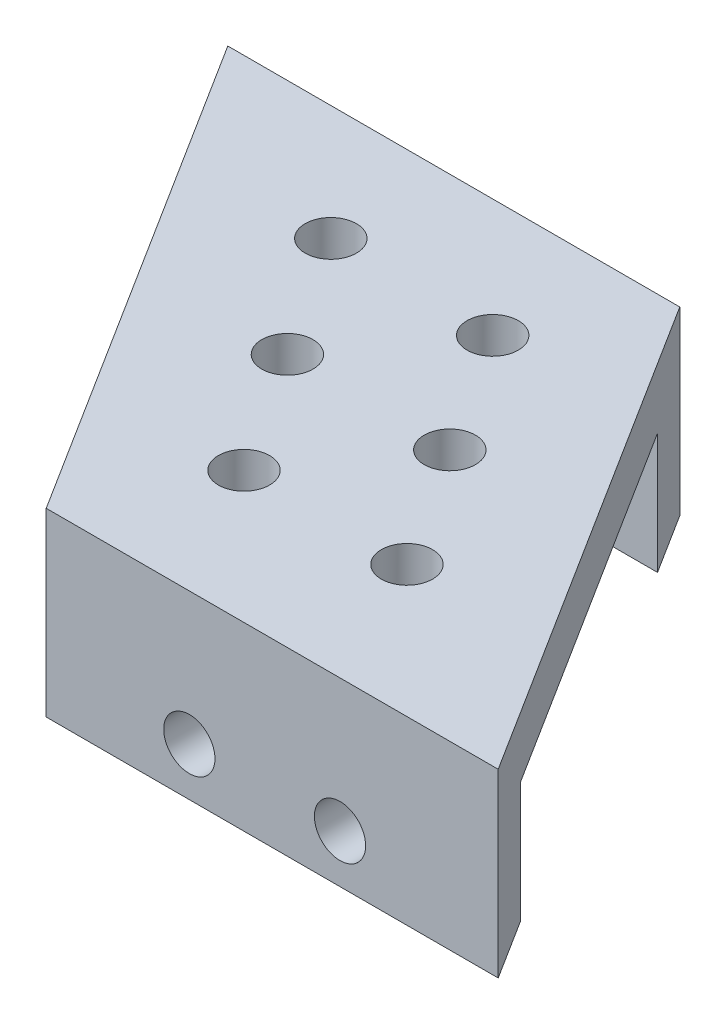
ISO-10303-21;
HEADER;
FILE_DESCRIPTION(('STEP AP214'),'2;1');
FILE_NAME('part.step','',(''),(''),'','','');
FILE_SCHEMA(('AUTOMOTIVE_DESIGN { 1 0 10303 214 1 1 1 1 }'));
ENDSEC;
DATA;
#1=APPLICATION_CONTEXT('core data for automotive mechanical design processes');
#2=APPLICATION_PROTOCOL_DEFINITION('international standard','automotive_design',2000,#1);
#3=PRODUCT_CONTEXT('',#1,'mechanical');
#4=PRODUCT('Part','Part','',(#3));
#5=PRODUCT_RELATED_PRODUCT_CATEGORY('part','',(#4));
#6=PRODUCT_DEFINITION_FORMATION('','',#4);
#7=PRODUCT_DEFINITION_CONTEXT('part definition',#1,'design');
#8=PRODUCT_DEFINITION('design','',#6,#7);
#9=PRODUCT_DEFINITION_SHAPE('','',#8);
#10=(LENGTH_UNIT() NAMED_UNIT(*) SI_UNIT(.MILLI.,.METRE.));
#11=(NAMED_UNIT(*) PLANE_ANGLE_UNIT() SI_UNIT($,.RADIAN.));
#12=(NAMED_UNIT(*) SI_UNIT($,.STERADIAN.) SOLID_ANGLE_UNIT());
#13=UNCERTAINTY_MEASURE_WITH_UNIT(LENGTH_MEASURE(1.E-05),#10,'distance_accuracy_value','');
#14=(GEOMETRIC_REPRESENTATION_CONTEXT(3) GLOBAL_UNCERTAINTY_ASSIGNED_CONTEXT((#13)) GLOBAL_UNIT_ASSIGNED_CONTEXT((#10,
#11,#12)) REPRESENTATION_CONTEXT('',''));
#15=CARTESIAN_POINT('',(0.,0.,0.));
#16=DIRECTION('',(0.,0.,1.));
#17=DIRECTION('',(1.,0.,0.));
#18=AXIS2_PLACEMENT_3D('',#15,#16,#17);
#19=CARTESIAN_POINT('',(0.,0.,0.));
#20=DIRECTION('',(0.,-1.,0.));
#21=DIRECTION('',(0.,0.,-1.));
#22=AXIS2_PLACEMENT_3D('',#19,#20,#21);
#23=PLANE('',#22);
#24=CARTESIAN_POINT('',(7.32925933436086,0.,16.7877627221562));
#25=DIRECTION('',(0.,-1.,0.));
#26=DIRECTION('',(0.,0.,-1.));
#27=AXIS2_PLACEMENT_3D('',#24,#25,#26);
#28=CIRCLE('',#27,1.70000000000051);
#29=CARTESIAN_POINT('',(7.32925933436086,0.,15.0877627221556));
#30=VERTEX_POINT('',#29);
#31=EDGE_CURVE('E127',#30,#30,#28,.T.);
#32=ORIENTED_EDGE('',*,*,#31,.F.);
#33=EDGE_LOOP('',(#32));
#34=FACE_BOUND('',#33,.T.);
#35=CARTESIAN_POINT('',(2.17031031728642,0.,8.78305398097484));
#36=DIRECTION('',(0.,-1.,0.));
#37=DIRECTION('',(0.,0.,-1.));
#38=AXIS2_PLACEMENT_3D('',#35,#36,#37);
#39=CIRCLE('',#38,1.70000000000056);
#40=CARTESIAN_POINT('',(2.17031031728642,0.,7.08305398097428));
#41=VERTEX_POINT('',#40);
#42=EDGE_CURVE('E224',#41,#41,#39,.T.);
#43=ORIENTED_EDGE('',*,*,#42,.F.);
#44=EDGE_LOOP('',(#43));
#45=FACE_BOUND('',#44,.T.);
#46=CARTESIAN_POINT('',(-2.98863869978802,0.,0.778345239793518));
#47=DIRECTION('',(0.,-1.,0.));
#48=DIRECTION('',(0.,0.,-1.));
#49=AXIS2_PLACEMENT_3D('',#46,#47,#48);
#50=CIRCLE('',#49,1.70000000000013);
#51=CARTESIAN_POINT('',(-2.98863869978802,0.,-0.921654760206616));
#52=VERTEX_POINT('',#51);
#53=EDGE_CURVE('E222',#52,#52,#50,.T.);
#54=ORIENTED_EDGE('',*,*,#53,.F.);
#55=EDGE_LOOP('',(#54));
#56=FACE_BOUND('',#55,.T.);
#57=CARTESIAN_POINT('',(-13.935807221514,0.,0.576164262539937));
#58=DIRECTION('',(0.,-1.,0.));
#59=DIRECTION('',(0.,0.,-1.));
#60=AXIS2_PLACEMENT_3D('',#57,#58,#59);
#61=CIRCLE('',#60,1.69999999999991);
#62=CARTESIAN_POINT('',(-13.935807221514,0.,-1.12383573745998));
#63=VERTEX_POINT('',#62);
#64=EDGE_CURVE('E219',#63,#63,#61,.T.);
#65=ORIENTED_EDGE('',*,*,#64,.F.);
#66=EDGE_LOOP('',(#65));
#67=FACE_BOUND('',#66,.T.);
#68=CARTESIAN_POINT('',(-8.71170646765569,0.,8.68196349234805));
#69=DIRECTION('',(0.,-1.,0.));
#70=DIRECTION('',(0.,0.,-1.));
#71=AXIS2_PLACEMENT_3D('',#68,#69,#70);
#72=CIRCLE('',#71,1.69999999999991);
#73=CARTESIAN_POINT('',(-8.71170646765569,0.,6.98196349234813));
#74=VERTEX_POINT('',#73);
#75=EDGE_CURVE('E216',#74,#74,#72,.T.);
#76=ORIENTED_EDGE('',*,*,#75,.F.);
#77=EDGE_LOOP('',(#76));
#78=FACE_BOUND('',#77,.T.);
#79=CARTESIAN_POINT('',(-3.48760571379741,0.,16.7877627221562));
#80=DIRECTION('',(0.,-1.,0.));
#81=DIRECTION('',(0.,0.,-1.));
#82=AXIS2_PLACEMENT_3D('',#79,#80,#81);
#83=CIRCLE('',#82,1.6999999999999);
#84=CARTESIAN_POINT('',(-3.48760571379741,0.,15.0877627221563));
#85=VERTEX_POINT('',#84);
#86=EDGE_CURVE('E213',#85,#85,#83,.T.);
#87=ORIENTED_EDGE('',*,*,#86,.F.);
#88=EDGE_LOOP('',(#87));
#89=FACE_BOUND('',#88,.T.);
#90=DIRECTION('',(-0.533210396162134,0.,-0.845982667331087));
#91=VECTOR('',#90,1.);
#92=CARTESIAN_POINT('',(1.58596151656593,0.,-7.06464984269321));
#93=LINE('',#92,#91);
#94=CARTESIAN_POINT('',(19.6121196391044,0.,21.5353501573068));
#95=VERTEX_POINT('',#94);
#96=CARTESIAN_POINT('',(4.10710251272519,0.,-3.06464984269317));
#97=VERTEX_POINT('',#96);
#98=EDGE_CURVE('E59',#95,#97,#93,.T.);
#99=ORIENTED_EDGE('',*,*,#98,.F.);
#100=DIRECTION('',(1.,0.,0.));
#101=VECTOR('',#100,1.);
#102=CARTESIAN_POINT('',(-10.3878803608956,0.,21.5353501573068));
#103=LINE('',#102,#101);
#104=CARTESIAN_POINT('',(-10.3878803608956,0.,21.5353501573068));
#105=VERTEX_POINT('',#104);
#106=EDGE_CURVE('E125',#105,#95,#103,.T.);
#107=ORIENTED_EDGE('',*,*,#106,.F.);
#108=DIRECTION('',(0.533210396162134,0.,0.845982667331087));
#109=VECTOR('',#108,1.);
#110=CARTESIAN_POINT('',(-7.86673936473637,0.,25.5353501573068));
#111=LINE('',#110,#109);
#112=CARTESIAN_POINT('',(-25.8928974872748,0.,-3.06464984269316));
#113=VERTEX_POINT('',#112);
#114=EDGE_CURVE('E156',#113,#105,#111,.T.);
#115=ORIENTED_EDGE('',*,*,#114,.F.);
#116=DIRECTION('',(-1.,0.,0.));
#117=VECTOR('',#116,1.);
#118=CARTESIAN_POINT('',(-25.8928974872748,0.,-3.06464984269316));
#119=LINE('',#118,#117);
#120=EDGE_CURVE('E137',#97,#113,#119,.T.);
#121=ORIENTED_EDGE('',*,*,#120,.F.);
#122=EDGE_LOOP('',(#99,#107,#115,#121));
#123=FACE_BOUND('',#122,.T.);
#124=ADVANCED_FACE('F34',(#34,#45,#56,#67,#78,#89,#123),#23,.T.);
#125=CARTESIAN_POINT('',(-28.4140384834341,4.,-7.06464984269316));
#126=DIRECTION('',(0.,0.,1.));
#127=DIRECTION('',(1.,0.,0.));
#128=AXIS2_PLACEMENT_3D('',#125,#126,#127);
#129=PLANE('',#128);
#130=CARTESIAN_POINT('',(-9.41403848343407,-4.8,-7.06464984269319));
#131=DIRECTION('',(0.,0.,-1.));
#132=DIRECTION('',(-1.,0.,0.));
#133=AXIS2_PLACEMENT_3D('',#130,#131,#132);
#134=CIRCLE('',#133,1.7);
#135=CARTESIAN_POINT('',(-11.1140384834341,-4.8,-7.06464984269319));
#136=VERTEX_POINT('',#135);
#137=EDGE_CURVE('E179',#136,#136,#134,.T.);
#138=ORIENTED_EDGE('',*,*,#137,.F.);
#139=EDGE_LOOP('',(#138));
#140=FACE_BOUND('',#139,.T.);
#141=CARTESIAN_POINT('',(-19.4140384834341,-4.8,-7.06464984269317));
#142=DIRECTION('',(0.,0.,-1.));
#143=DIRECTION('',(-1.,0.,0.));
#144=AXIS2_PLACEMENT_3D('',#141,#142,#143);
#145=CIRCLE('',#144,1.7);
#146=CARTESIAN_POINT('',(-21.1140384834341,-4.8,-7.06464984269317));
#147=VERTEX_POINT('',#146);
#148=EDGE_CURVE('E185',#147,#147,#145,.T.);
#149=ORIENTED_EDGE('',*,*,#148,.F.);
#150=EDGE_LOOP('',(#149));
#151=FACE_BOUND('',#150,.T.);
#152=DIRECTION('',(0.,-1.,0.));
#153=VECTOR('',#152,1.);
#154=CARTESIAN_POINT('',(1.58596151656593,4.,-7.06464984269321));
#155=LINE('',#154,#153);
#156=CARTESIAN_POINT('',(1.58596151656593,4.,-7.06464984269321));
#157=VERTEX_POINT('',#156);
#158=CARTESIAN_POINT('',(1.58596151656593,-8.,-7.06464984269321));
#159=VERTEX_POINT('',#158);
#160=EDGE_CURVE('E112',#157,#159,#155,.T.);
#161=ORIENTED_EDGE('',*,*,#160,.T.);
#162=DIRECTION('',(1.,0.,0.));
#163=VECTOR('',#162,1.);
#164=CARTESIAN_POINT('',(1.58596151656593,-8.,-7.06464984269321));
#165=LINE('',#164,#163);
#166=CARTESIAN_POINT('',(-28.4140384834341,-8.,-7.06464984269316));
#167=VERTEX_POINT('',#166);
#168=EDGE_CURVE('E138',#167,#159,#165,.T.);
#169=ORIENTED_EDGE('',*,*,#168,.F.);
#170=DIRECTION('',(0.,-1.,0.));
#171=VECTOR('',#170,1.);
#172=CARTESIAN_POINT('',(-28.4140384834341,4.,-7.06464984269316));
#173=LINE('',#172,#171);
#174=CARTESIAN_POINT('',(-28.4140384834341,4.,-7.06464984269316));
#175=VERTEX_POINT('',#174);
#176=EDGE_CURVE('E11',#175,#167,#173,.T.);
#177=ORIENTED_EDGE('',*,*,#176,.F.);
#178=DIRECTION('',(-1.,0.,0.));
#179=VECTOR('',#178,1.);
#180=CARTESIAN_POINT('',(-28.4140384834341,4.,-7.06464984269316));
#181=LINE('',#180,#179);
#182=EDGE_CURVE('E157',#157,#175,#181,.T.);
#183=ORIENTED_EDGE('',*,*,#182,.F.);
#184=EDGE_LOOP('',(#161,#169,#177,#183));
#185=FACE_BOUND('',#184,.T.);
#186=ADVANCED_FACE('F36',(#140,#151,#185),#129,.F.);
#187=CARTESIAN_POINT('',(-7.86673936473637,4.,25.5353501573068));
#188=DIRECTION('',(0.845982667331087,0.,-0.533210396162134));
#189=DIRECTION('',(-0.533210396162134,0.,-0.845982667331087));
#190=AXIS2_PLACEMENT_3D('',#187,#188,#189);
#191=PLANE('',#190);
#192=ORIENTED_EDGE('',*,*,#176,.T.);
#193=DIRECTION('',(-0.533210396162134,0.,-0.845982667331087));
#194=VECTOR('',#193,1.);
#195=CARTESIAN_POINT('',(-28.4140384834341,-8.,-7.06464984269316));
#196=LINE('',#195,#194);
#197=CARTESIAN_POINT('',(-25.8928974872748,-8.,-3.06464984269316));
#198=VERTEX_POINT('',#197);
#199=EDGE_CURVE('E145',#198,#167,#196,.T.);
#200=ORIENTED_EDGE('',*,*,#199,.F.);
#201=DIRECTION('',(0.,1.,0.));
#202=VECTOR('',#201,1.);
#203=CARTESIAN_POINT('',(-25.8928974872748,-8.,-3.06464984269316));
#204=LINE('',#203,#202);
#205=EDGE_CURVE('E148',#198,#113,#204,.T.);
#206=ORIENTED_EDGE('',*,*,#205,.T.);
#207=ORIENTED_EDGE('',*,*,#114,.T.);
#208=DIRECTION('',(0.,1.,0.));
#209=VECTOR('',#208,1.);
#210=CARTESIAN_POINT('',(-10.3878803608956,-8.,21.5353501573068));
#211=LINE('',#210,#209);
#212=CARTESIAN_POINT('',(-10.3878803608956,-8.,21.5353501573068));
#213=VERTEX_POINT('',#212);
#214=EDGE_CURVE('E51',#213,#105,#211,.T.);
#215=ORIENTED_EDGE('',*,*,#214,.F.);
#216=DIRECTION('',(-0.533210396162133,0.,-0.845982667331087));
#217=VECTOR('',#216,1.);
#218=CARTESIAN_POINT('',(-7.86673936473637,-8.,25.5353501573068));
#219=LINE('',#218,#217);
#220=CARTESIAN_POINT('',(-7.86673936473637,-8.,25.5353501573068));
#221=VERTEX_POINT('',#220);
#222=EDGE_CURVE('E120',#221,#213,#219,.T.);
#223=ORIENTED_EDGE('',*,*,#222,.F.);
#224=DIRECTION('',(0.,-1.,0.));
#225=VECTOR('',#224,1.);
#226=CARTESIAN_POINT('',(-7.86673936473637,4.,25.5353501573068));
#227=LINE('',#226,#225);
#228=CARTESIAN_POINT('',(-7.86673936473637,4.,25.5353501573068));
#229=VERTEX_POINT('',#228);
#230=EDGE_CURVE('E43',#229,#221,#227,.T.);
#231=ORIENTED_EDGE('',*,*,#230,.F.);
#232=DIRECTION('',(0.533210396162134,0.,0.845982667331087));
#233=VECTOR('',#232,1.);
#234=CARTESIAN_POINT('',(-7.86673936473637,4.,25.5353501573068));
#235=LINE('',#234,#233);
#236=EDGE_CURVE('E160',#175,#229,#235,.T.);
#237=ORIENTED_EDGE('',*,*,#236,.F.);
#238=EDGE_LOOP('',(#192,#200,#206,#207,#215,#223,#231,#237));
#239=FACE_BOUND('',#238,.T.);
#240=ADVANCED_FACE('F261',(#239),#191,.F.);
#241=CARTESIAN_POINT('',(22.1332606352636,4.,25.5353501573068));
#242=DIRECTION('',(0.,0.,-1.));
#243=DIRECTION('',(-1.,0.,0.));
#244=AXIS2_PLACEMENT_3D('',#241,#242,#243);
#245=PLANE('',#244);
#246=CARTESIAN_POINT('',(1.63326063526363,-4.8,25.5353501573068));
#247=DIRECTION('',(0.,0.,1.));
#248=DIRECTION('',(1.,0.,0.));
#249=AXIS2_PLACEMENT_3D('',#246,#247,#248);
#250=CIRCLE('',#249,1.7);
#251=CARTESIAN_POINT('',(3.33326063526363,-4.8,25.5353501573068));
#252=VERTEX_POINT('',#251);
#253=EDGE_CURVE('E174',#252,#252,#250,.T.);
#254=ORIENTED_EDGE('',*,*,#253,.F.);
#255=EDGE_LOOP('',(#254));
#256=FACE_BOUND('',#255,.T.);
#257=CARTESIAN_POINT('',(11.6332606352636,-4.8,25.5353501573068));
#258=DIRECTION('',(0.,0.,1.));
#259=DIRECTION('',(1.,0.,0.));
#260=AXIS2_PLACEMENT_3D('',#257,#258,#259);
#261=CIRCLE('',#260,1.7);
#262=CARTESIAN_POINT('',(13.3332606352636,-4.8,25.5353501573068));
#263=VERTEX_POINT('',#262);
#264=EDGE_CURVE('E183',#263,#263,#261,.T.);
#265=ORIENTED_EDGE('',*,*,#264,.F.);
#266=EDGE_LOOP('',(#265));
#267=FACE_BOUND('',#266,.T.);
#268=ORIENTED_EDGE('',*,*,#230,.T.);
#269=DIRECTION('',(-1.,0.,0.));
#270=VECTOR('',#269,1.);
#271=CARTESIAN_POINT('',(22.1332606352636,-8.,25.5353501573068));
#272=LINE('',#271,#270);
#273=CARTESIAN_POINT('',(22.1332606352636,-8.,25.5353501573068));
#274=VERTEX_POINT('',#273);
#275=EDGE_CURVE('E115',#274,#221,#272,.T.);
#276=ORIENTED_EDGE('',*,*,#275,.F.);
#277=DIRECTION('',(0.,-1.,0.));
#278=VECTOR('',#277,1.);
#279=CARTESIAN_POINT('',(22.1332606352636,4.,25.5353501573068));
#280=LINE('',#279,#278);
#281=CARTESIAN_POINT('',(22.1332606352636,4.,25.5353501573068));
#282=VERTEX_POINT('',#281);
#283=EDGE_CURVE('E103',#282,#274,#280,.T.);
#284=ORIENTED_EDGE('',*,*,#283,.F.);
#285=DIRECTION('',(1.,0.,0.));
#286=VECTOR('',#285,1.);
#287=CARTESIAN_POINT('',(22.1332606352636,4.,25.5353501573068));
#288=LINE('',#287,#286);
#289=EDGE_CURVE('E162',#229,#282,#288,.T.);
#290=ORIENTED_EDGE('',*,*,#289,.F.);
#291=EDGE_LOOP('',(#268,#276,#284,#290));
#292=FACE_BOUND('',#291,.T.);
#293=ADVANCED_FACE('F116',(#256,#267,#292),#245,.F.);
#294=CARTESIAN_POINT('',(1.58596151656593,4.,-7.06464984269321));
#295=DIRECTION('',(-0.845982667331087,0.,0.533210396162134));
#296=DIRECTION('',(0.533210396162134,0.,0.845982667331087));
#297=AXIS2_PLACEMENT_3D('',#294,#295,#296);
#298=PLANE('',#297);
#299=ORIENTED_EDGE('',*,*,#283,.T.);
#300=DIRECTION('',(0.533210396162134,0.,0.845982667331087));
#301=VECTOR('',#300,1.);
#302=CARTESIAN_POINT('',(19.6121196391044,-8.,21.5353501573068));
#303=LINE('',#302,#301);
#304=CARTESIAN_POINT('',(19.6121196391044,-8.,21.5353501573068));
#305=VERTEX_POINT('',#304);
#306=EDGE_CURVE('E107',#305,#274,#303,.T.);
#307=ORIENTED_EDGE('',*,*,#306,.F.);
#308=DIRECTION('',(0.,1.,0.));
#309=VECTOR('',#308,1.);
#310=CARTESIAN_POINT('',(19.6121196391044,-8.,21.5353501573068));
#311=LINE('',#310,#309);
#312=EDGE_CURVE('E133',#305,#95,#311,.T.);
#313=ORIENTED_EDGE('',*,*,#312,.T.);
#314=ORIENTED_EDGE('',*,*,#98,.T.);
#315=DIRECTION('',(0.,1.,0.));
#316=VECTOR('',#315,1.);
#317=CARTESIAN_POINT('',(4.10710251272519,-8.,-3.06464984269316));
#318=LINE('',#317,#316);
#319=CARTESIAN_POINT('',(4.10710251272519,-8.,-3.06464984269316));
#320=VERTEX_POINT('',#319);
#321=EDGE_CURVE('E153',#320,#97,#318,.T.);
#322=ORIENTED_EDGE('',*,*,#321,.F.);
#323=DIRECTION('',(0.533210396162134,0.,0.845982667331087));
#324=VECTOR('',#323,1.);
#325=CARTESIAN_POINT('',(4.10710251272519,-8.,-3.06464984269316));
#326=LINE('',#325,#324);
#327=EDGE_CURVE('E141',#159,#320,#326,.T.);
#328=ORIENTED_EDGE('',*,*,#327,.F.);
#329=ORIENTED_EDGE('',*,*,#160,.F.);
#330=DIRECTION('',(-0.533210396162134,0.,-0.845982667331087));
#331=VECTOR('',#330,1.);
#332=CARTESIAN_POINT('',(1.58596151656593,4.,-7.06464984269321));
#333=LINE('',#332,#331);
#334=EDGE_CURVE('E109',#282,#157,#333,.T.);
#335=ORIENTED_EDGE('',*,*,#334,.F.);
#336=EDGE_LOOP('',(#299,#307,#313,#314,#322,#328,#329,#335));
#337=FACE_BOUND('',#336,.T.);
#338=ADVANCED_FACE('F105',(#337),#298,.F.);
#339=CARTESIAN_POINT('',(0.,4.,0.));
#340=DIRECTION('',(0.,-1.,0.));
#341=DIRECTION('',(0.,0.,-1.));
#342=AXIS2_PLACEMENT_3D('',#339,#340,#341);
#343=PLANE('',#342);
#344=CARTESIAN_POINT('',(7.32925933436086,4.,16.7877627221562));
#345=DIRECTION('',(0.,1.,0.));
#346=DIRECTION('',(0.,0.,1.));
#347=AXIS2_PLACEMENT_3D('',#344,#345,#346);
#348=CIRCLE('',#347,1.70000000000051);
#349=CARTESIAN_POINT('',(7.32925933436086,4.,18.4877627221567));
#350=VERTEX_POINT('',#349);
#351=EDGE_CURVE('E199',#350,#350,#348,.T.);
#352=ORIENTED_EDGE('',*,*,#351,.F.);
#353=EDGE_LOOP('',(#352));
#354=FACE_BOUND('',#353,.T.);
#355=CARTESIAN_POINT('',(2.17031031728642,4.,8.78305398097484));
#356=DIRECTION('',(0.,1.,0.));
#357=DIRECTION('',(0.,0.,1.));
#358=AXIS2_PLACEMENT_3D('',#355,#356,#357);
#359=CIRCLE('',#358,1.70000000000056);
#360=CARTESIAN_POINT('',(2.17031031728642,4.,10.4830539809754));
#361=VERTEX_POINT('',#360);
#362=EDGE_CURVE('E203',#361,#361,#359,.T.);
#363=ORIENTED_EDGE('',*,*,#362,.F.);
#364=EDGE_LOOP('',(#363));
#365=FACE_BOUND('',#364,.T.);
#366=CARTESIAN_POINT('',(-2.98863869978802,4.,0.778345239793518));
#367=DIRECTION('',(0.,1.,0.));
#368=DIRECTION('',(0.,0.,1.));
#369=AXIS2_PLACEMENT_3D('',#366,#367,#368);
#370=CIRCLE('',#369,1.70000000000013);
#371=CARTESIAN_POINT('',(-2.98863869978802,4.,2.47834523979365));
#372=VERTEX_POINT('',#371);
#373=EDGE_CURVE('E206',#372,#372,#370,.T.);
#374=ORIENTED_EDGE('',*,*,#373,.F.);
#375=EDGE_LOOP('',(#374));
#376=FACE_BOUND('',#375,.T.);
#377=CARTESIAN_POINT('',(-13.935807221514,4.,0.576164262539937));
#378=DIRECTION('',(0.,1.,0.));
#379=DIRECTION('',(0.,0.,1.));
#380=AXIS2_PLACEMENT_3D('',#377,#378,#379);
#381=CIRCLE('',#380,1.69999999999991);
#382=CARTESIAN_POINT('',(-13.935807221514,4.,2.27616426253985));
#383=VERTEX_POINT('',#382);
#384=EDGE_CURVE('E198',#383,#383,#381,.T.);
#385=ORIENTED_EDGE('',*,*,#384,.F.);
#386=EDGE_LOOP('',(#385));
#387=FACE_BOUND('',#386,.T.);
#388=CARTESIAN_POINT('',(-8.71170646765569,4.,8.68196349234805));
#389=DIRECTION('',(0.,1.,0.));
#390=DIRECTION('',(0.,0.,1.));
#391=AXIS2_PLACEMENT_3D('',#388,#389,#390);
#392=CIRCLE('',#391,1.69999999999991);
#393=CARTESIAN_POINT('',(-8.71170646765569,4.,10.381963492348));
#394=VERTEX_POINT('',#393);
#395=EDGE_CURVE('E176',#394,#394,#392,.T.);
#396=ORIENTED_EDGE('',*,*,#395,.F.);
#397=EDGE_LOOP('',(#396));
#398=FACE_BOUND('',#397,.T.);
#399=CARTESIAN_POINT('',(-3.48760571379741,4.,16.7877627221562));
#400=DIRECTION('',(0.,1.,0.));
#401=DIRECTION('',(0.,0.,1.));
#402=AXIS2_PLACEMENT_3D('',#399,#400,#401);
#403=CIRCLE('',#402,1.6999999999999);
#404=CARTESIAN_POINT('',(-3.48760571379741,4.,18.4877627221561));
#405=VERTEX_POINT('',#404);
#406=EDGE_CURVE('E202',#405,#405,#403,.T.);
#407=ORIENTED_EDGE('',*,*,#406,.F.);
#408=EDGE_LOOP('',(#407));
#409=FACE_BOUND('',#408,.T.);
#410=ORIENTED_EDGE('',*,*,#182,.T.);
#411=ORIENTED_EDGE('',*,*,#236,.T.);
#412=ORIENTED_EDGE('',*,*,#289,.T.);
#413=ORIENTED_EDGE('',*,*,#334,.T.);
#414=EDGE_LOOP('',(#410,#411,#412,#413));
#415=FACE_BOUND('',#414,.T.);
#416=ADVANCED_FACE('F259',(#354,#365,#376,#387,#398,#409,#415),#343,.F.);
#417=CARTESIAN_POINT('',(-25.8928974872748,-8.,-3.06464984269316));
#418=DIRECTION('',(0.,0.,-1.));
#419=DIRECTION('',(-1.,0.,0.));
#420=AXIS2_PLACEMENT_3D('',#417,#418,#419);
#421=PLANE('',#420);
#422=CARTESIAN_POINT('',(-9.41403848343406,-4.8,-3.06464984269317));
#423=DIRECTION('',(0.,0.,-1.));
#424=DIRECTION('',(-1.,0.,0.));
#425=AXIS2_PLACEMENT_3D('',#422,#423,#424);
#426=CIRCLE('',#425,1.7);
#427=CARTESIAN_POINT('',(-11.1140384834341,-4.8,-3.06464984269317));
#428=VERTEX_POINT('',#427);
#429=EDGE_CURVE('E38',#428,#428,#426,.T.);
#430=ORIENTED_EDGE('',*,*,#429,.T.);
#431=EDGE_LOOP('',(#430));
#432=FACE_BOUND('',#431,.T.);
#433=CARTESIAN_POINT('',(-19.4140384834341,-4.8,-3.06464984269316));
#434=DIRECTION('',(0.,0.,-1.));
#435=DIRECTION('',(-1.,0.,0.));
#436=AXIS2_PLACEMENT_3D('',#433,#434,#435);
#437=CIRCLE('',#436,1.7);
#438=CARTESIAN_POINT('',(-21.1140384834341,-4.8,-3.06464984269316));
#439=VERTEX_POINT('',#438);
#440=EDGE_CURVE('E177',#439,#439,#437,.T.);
#441=ORIENTED_EDGE('',*,*,#440,.T.);
#442=EDGE_LOOP('',(#441));
#443=FACE_BOUND('',#442,.T.);
#444=ORIENTED_EDGE('',*,*,#120,.T.);
#445=ORIENTED_EDGE('',*,*,#205,.F.);
#446=DIRECTION('',(-1.,0.,0.));
#447=VECTOR('',#446,1.);
#448=CARTESIAN_POINT('',(-25.8928974872748,-8.,-3.06464984269316));
#449=LINE('',#448,#447);
#450=EDGE_CURVE('E143',#320,#198,#449,.T.);
#451=ORIENTED_EDGE('',*,*,#450,.F.);
#452=ORIENTED_EDGE('',*,*,#321,.T.);
#453=EDGE_LOOP('',(#444,#445,#451,#452));
#454=FACE_BOUND('',#453,.T.);
#455=ADVANCED_FACE('F249',(#432,#443,#454),#421,.F.);
#456=CARTESIAN_POINT('',(0.,-8.,0.));
#457=DIRECTION('',(0.,1.,0.));
#458=DIRECTION('',(0.,0.,1.));
#459=AXIS2_PLACEMENT_3D('',#456,#457,#458);
#460=PLANE('',#459);
#461=ORIENTED_EDGE('',*,*,#168,.T.);
#462=ORIENTED_EDGE('',*,*,#327,.T.);
#463=ORIENTED_EDGE('',*,*,#450,.T.);
#464=ORIENTED_EDGE('',*,*,#199,.T.);
#465=EDGE_LOOP('',(#461,#462,#463,#464));
#466=FACE_BOUND('',#465,.T.);
#467=ADVANCED_FACE('F254',(#466),#460,.F.);
#468=CARTESIAN_POINT('',(-10.3878803608956,-8.,21.5353501573068));
#469=DIRECTION('',(0.,0.,1.));
#470=DIRECTION('',(1.,0.,0.));
#471=AXIS2_PLACEMENT_3D('',#468,#469,#470);
#472=PLANE('',#471);
#473=CARTESIAN_POINT('',(1.63326063526363,-4.8,21.5353501573068));
#474=DIRECTION('',(0.,0.,1.));
#475=DIRECTION('',(1.,0.,0.));
#476=AXIS2_PLACEMENT_3D('',#473,#474,#475);
#477=CIRCLE('',#476,1.7);
#478=CARTESIAN_POINT('',(3.33326063526363,-4.8,21.5353501573068));
#479=VERTEX_POINT('',#478);
#480=EDGE_CURVE('E173',#479,#479,#477,.T.);
#481=ORIENTED_EDGE('',*,*,#480,.T.);
#482=EDGE_LOOP('',(#481));
#483=FACE_BOUND('',#482,.T.);
#484=CARTESIAN_POINT('',(11.6332606352636,-4.8,21.5353501573068));
#485=DIRECTION('',(0.,0.,1.));
#486=DIRECTION('',(1.,0.,0.));
#487=AXIS2_PLACEMENT_3D('',#484,#485,#486);
#488=CIRCLE('',#487,1.7);
#489=CARTESIAN_POINT('',(13.3332606352636,-4.8,21.5353501573068));
#490=VERTEX_POINT('',#489);
#491=EDGE_CURVE('E170',#490,#490,#488,.T.);
#492=ORIENTED_EDGE('',*,*,#491,.T.);
#493=EDGE_LOOP('',(#492));
#494=FACE_BOUND('',#493,.T.);
#495=ORIENTED_EDGE('',*,*,#106,.T.);
#496=ORIENTED_EDGE('',*,*,#312,.F.);
#497=DIRECTION('',(1.,0.,0.));
#498=VECTOR('',#497,1.);
#499=CARTESIAN_POINT('',(-10.3878803608956,-8.,21.5353501573068));
#500=LINE('',#499,#498);
#501=EDGE_CURVE('E123',#213,#305,#500,.T.);
#502=ORIENTED_EDGE('',*,*,#501,.F.);
#503=ORIENTED_EDGE('',*,*,#214,.T.);
#504=EDGE_LOOP('',(#495,#496,#502,#503));
#505=FACE_BOUND('',#504,.T.);
#506=ADVANCED_FACE('F262',(#483,#494,#505),#472,.F.);
#507=CARTESIAN_POINT('',(0.,-8.,0.));
#508=DIRECTION('',(0.,-1.,0.));
#509=DIRECTION('',(0.,0.,-1.));
#510=AXIS2_PLACEMENT_3D('',#507,#508,#509);
#511=PLANE('',#510);
#512=ORIENTED_EDGE('',*,*,#306,.T.);
#513=ORIENTED_EDGE('',*,*,#275,.T.);
#514=ORIENTED_EDGE('',*,*,#222,.T.);
#515=ORIENTED_EDGE('',*,*,#501,.T.);
#516=EDGE_LOOP('',(#512,#513,#514,#515));
#517=FACE_BOUND('',#516,.T.);
#518=ADVANCED_FACE('F122',(#517),#511,.T.);
#519=CARTESIAN_POINT('',(-3.48760571379741,-8.,16.7877627221562));
#520=DIRECTION('',(0.,1.,0.));
#521=DIRECTION('',(0.,0.,1.));
#522=AXIS2_PLACEMENT_3D('',#519,#520,#521);
#523=CYLINDRICAL_SURFACE('',#522,1.6999999999999);
#524=ORIENTED_EDGE('',*,*,#86,.T.);
#525=EDGE_LOOP('',(#524));
#526=FACE_BOUND('',#525,.T.);
#527=ORIENTED_EDGE('',*,*,#406,.T.);
#528=EDGE_LOOP('',(#527));
#529=FACE_BOUND('',#528,.T.);
#530=ADVANCED_FACE('F270',(#526,#529),#523,.F.);
#531=CARTESIAN_POINT('',(-8.71170646765569,-8.,8.68196349234805));
#532=DIRECTION('',(0.,1.,0.));
#533=DIRECTION('',(0.,0.,1.));
#534=AXIS2_PLACEMENT_3D('',#531,#532,#533);
#535=CYLINDRICAL_SURFACE('',#534,1.69999999999991);
#536=ORIENTED_EDGE('',*,*,#75,.T.);
#537=EDGE_LOOP('',(#536));
#538=FACE_BOUND('',#537,.T.);
#539=ORIENTED_EDGE('',*,*,#395,.T.);
#540=EDGE_LOOP('',(#539));
#541=FACE_BOUND('',#540,.T.);
#542=ADVANCED_FACE('F314',(#538,#541),#535,.F.);
#543=CARTESIAN_POINT('',(-13.935807221514,-8.,0.576164262539937));
#544=DIRECTION('',(0.,1.,0.));
#545=DIRECTION('',(0.,0.,1.));
#546=AXIS2_PLACEMENT_3D('',#543,#544,#545);
#547=CYLINDRICAL_SURFACE('',#546,1.69999999999991);
#548=ORIENTED_EDGE('',*,*,#64,.T.);
#549=EDGE_LOOP('',(#548));
#550=FACE_BOUND('',#549,.T.);
#551=ORIENTED_EDGE('',*,*,#384,.T.);
#552=EDGE_LOOP('',(#551));
#553=FACE_BOUND('',#552,.T.);
#554=ADVANCED_FACE('F317',(#550,#553),#547,.F.);
#555=CARTESIAN_POINT('',(-2.98863869978802,-8.,0.778345239793518));
#556=DIRECTION('',(0.,1.,0.));
#557=DIRECTION('',(0.,0.,1.));
#558=AXIS2_PLACEMENT_3D('',#555,#556,#557);
#559=CYLINDRICAL_SURFACE('',#558,1.70000000000013);
#560=ORIENTED_EDGE('',*,*,#53,.T.);
#561=EDGE_LOOP('',(#560));
#562=FACE_BOUND('',#561,.T.);
#563=ORIENTED_EDGE('',*,*,#373,.T.);
#564=EDGE_LOOP('',(#563));
#565=FACE_BOUND('',#564,.T.);
#566=ADVANCED_FACE('F324',(#562,#565),#559,.F.);
#567=CARTESIAN_POINT('',(2.17031031728642,-8.,8.78305398097484));
#568=DIRECTION('',(0.,1.,0.));
#569=DIRECTION('',(0.,0.,1.));
#570=AXIS2_PLACEMENT_3D('',#567,#568,#569);
#571=CYLINDRICAL_SURFACE('',#570,1.70000000000056);
#572=ORIENTED_EDGE('',*,*,#42,.T.);
#573=EDGE_LOOP('',(#572));
#574=FACE_BOUND('',#573,.T.);
#575=ORIENTED_EDGE('',*,*,#362,.T.);
#576=EDGE_LOOP('',(#575));
#577=FACE_BOUND('',#576,.T.);
#578=ADVANCED_FACE('F321',(#574,#577),#571,.F.);
#579=CARTESIAN_POINT('',(7.32925933436086,-8.,16.7877627221562));
#580=DIRECTION('',(0.,1.,0.));
#581=DIRECTION('',(0.,0.,1.));
#582=AXIS2_PLACEMENT_3D('',#579,#580,#581);
#583=CYLINDRICAL_SURFACE('',#582,1.70000000000051);
#584=ORIENTED_EDGE('',*,*,#31,.T.);
#585=EDGE_LOOP('',(#584));
#586=FACE_BOUND('',#585,.T.);
#587=ORIENTED_EDGE('',*,*,#351,.T.);
#588=EDGE_LOOP('',(#587));
#589=FACE_BOUND('',#588,.T.);
#590=ADVANCED_FACE('F231',(#586,#589),#583,.F.);
#591=CARTESIAN_POINT('',(11.6332606352636,-4.8,15.5353501573068));
#592=DIRECTION('',(0.,0.,1.));
#593=DIRECTION('',(1.,0.,0.));
#594=AXIS2_PLACEMENT_3D('',#591,#592,#593);
#595=CYLINDRICAL_SURFACE('',#594,1.7);
#596=ORIENTED_EDGE('',*,*,#264,.T.);
#597=EDGE_LOOP('',(#596));
#598=FACE_BOUND('',#597,.T.);
#599=ORIENTED_EDGE('',*,*,#491,.F.);
#600=EDGE_LOOP('',(#599));
#601=FACE_BOUND('',#600,.T.);
#602=ADVANCED_FACE('F307',(#598,#601),#595,.F.);
#603=CARTESIAN_POINT('',(1.63326063526363,-4.8,15.5353501573068));
#604=DIRECTION('',(0.,0.,1.));
#605=DIRECTION('',(1.,0.,0.));
#606=AXIS2_PLACEMENT_3D('',#603,#604,#605);
#607=CYLINDRICAL_SURFACE('',#606,1.7);
#608=ORIENTED_EDGE('',*,*,#253,.T.);
#609=EDGE_LOOP('',(#608));
#610=FACE_BOUND('',#609,.T.);
#611=ORIENTED_EDGE('',*,*,#480,.F.);
#612=EDGE_LOOP('',(#611));
#613=FACE_BOUND('',#612,.T.);
#614=ADVANCED_FACE('F300',(#610,#613),#607,.F.);
#615=CARTESIAN_POINT('',(-19.4140384834341,-4.8,2.93535015730683));
#616=DIRECTION('',(0.,0.,-1.));
#617=DIRECTION('',(-1.,0.,0.));
#618=AXIS2_PLACEMENT_3D('',#615,#616,#617);
#619=CYLINDRICAL_SURFACE('',#618,1.7);
#620=ORIENTED_EDGE('',*,*,#148,.T.);
#621=EDGE_LOOP('',(#620));
#622=FACE_BOUND('',#621,.T.);
#623=ORIENTED_EDGE('',*,*,#440,.F.);
#624=EDGE_LOOP('',(#623));
#625=FACE_BOUND('',#624,.T.);
#626=ADVANCED_FACE('F296',(#622,#625),#619,.F.);
#627=CARTESIAN_POINT('',(-9.41403848343405,-4.8,2.93535015730681));
#628=DIRECTION('',(0.,0.,-1.));
#629=DIRECTION('',(-1.,0.,0.));
#630=AXIS2_PLACEMENT_3D('',#627,#628,#629);
#631=CYLINDRICAL_SURFACE('',#630,1.7);
#632=ORIENTED_EDGE('',*,*,#137,.T.);
#633=EDGE_LOOP('',(#632));
#634=FACE_BOUND('',#633,.T.);
#635=ORIENTED_EDGE('',*,*,#429,.F.);
#636=EDGE_LOOP('',(#635));
#637=FACE_BOUND('',#636,.T.);
#638=ADVANCED_FACE('F299',(#634,#637),#631,.F.);
#639=CLOSED_SHELL('',(#124,#186,#240,#293,#338,#416,#455,#467,#506,#518,#530,#542,#554,#566,
#578,#590,#602,#614,#626,#638));
#640=MANIFOLD_SOLID_BREP('B2',#639);
#641=ADVANCED_BREP_SHAPE_REPRESENTATION('',(#18,#640),#14);
#642=SHAPE_DEFINITION_REPRESENTATION(#9,#641);
ENDSEC;
END-ISO-10303-21;
